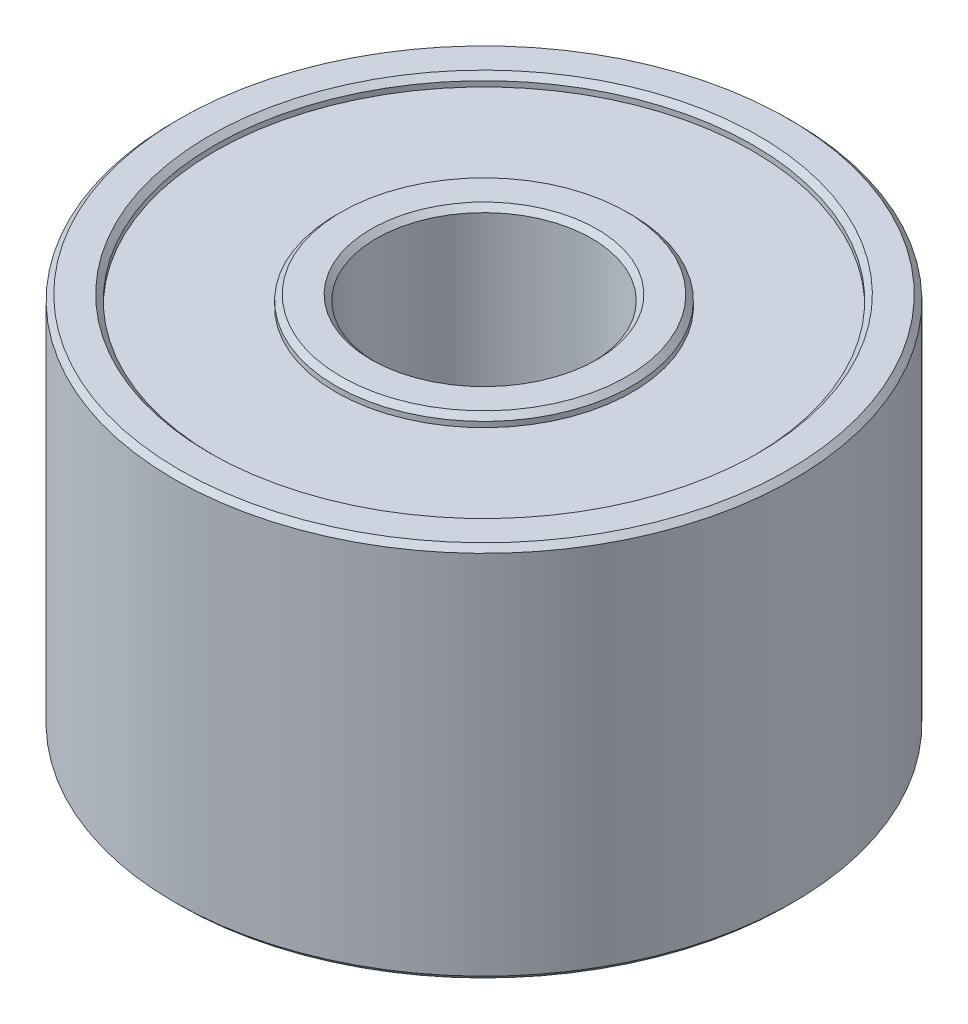
ISO-10303-21;
HEADER;
FILE_DESCRIPTION(('STEP AP214'),'2;1');
FILE_NAME('part.step','',(''),(''),'','','');
FILE_SCHEMA(('AUTOMOTIVE_DESIGN { 1 0 10303 214 1 1 1 1 }'));
ENDSEC;
DATA;
#1=APPLICATION_CONTEXT('core data for automotive mechanical design processes');
#2=APPLICATION_PROTOCOL_DEFINITION('international standard','automotive_design',2000,#1);
#3=PRODUCT_CONTEXT('',#1,'mechanical');
#4=PRODUCT('Part','Part','',(#3));
#5=PRODUCT_RELATED_PRODUCT_CATEGORY('part','',(#4));
#6=PRODUCT_DEFINITION_FORMATION('','',#4);
#7=PRODUCT_DEFINITION_CONTEXT('part definition',#1,'design');
#8=PRODUCT_DEFINITION('design','',#6,#7);
#9=PRODUCT_DEFINITION_SHAPE('','',#8);
#10=(LENGTH_UNIT() NAMED_UNIT(*) SI_UNIT(.MILLI.,.METRE.));
#11=(NAMED_UNIT(*) PLANE_ANGLE_UNIT() SI_UNIT($,.RADIAN.));
#12=(NAMED_UNIT(*) SI_UNIT($,.STERADIAN.) SOLID_ANGLE_UNIT());
#13=UNCERTAINTY_MEASURE_WITH_UNIT(LENGTH_MEASURE(1.E-05),#10,'distance_accuracy_value','');
#14=(GEOMETRIC_REPRESENTATION_CONTEXT(3) GLOBAL_UNCERTAINTY_ASSIGNED_CONTEXT((#13)) GLOBAL_UNIT_ASSIGNED_CONTEXT((#10,
#11,#12)) REPRESENTATION_CONTEXT('',''));
#15=CARTESIAN_POINT('',(0.,0.,0.));
#16=DIRECTION('',(0.,0.,1.));
#17=DIRECTION('',(1.,0.,0.));
#18=AXIS2_PLACEMENT_3D('',#15,#16,#17);
#19=CARTESIAN_POINT('',(0.,0.,0.));
#20=DIRECTION('',(0.,1.,0.));
#21=DIRECTION('',(0.,0.,1.));
#22=AXIS2_PLACEMENT_3D('',#19,#20,#21);
#23=PLANE('',#22);
#24=CARTESIAN_POINT('',(0.,0.,0.));
#25=DIRECTION('',(0.,1.,0.));
#26=DIRECTION('',(0.,0.,1.));
#27=AXIS2_PLACEMENT_3D('',#24,#25,#26);
#28=CIRCLE('',#27,5.3);
#29=CARTESIAN_POINT('',(0.,0.,5.3));
#30=VERTEX_POINT('',#29);
#31=EDGE_CURVE('E38',#30,#30,#28,.F.);
#32=ORIENTED_EDGE('',*,*,#31,.T.);
#33=EDGE_LOOP('',(#32));
#34=FACE_BOUND('',#33,.T.);
#35=CARTESIAN_POINT('',(0.,0.,0.));
#36=DIRECTION('',(0.,1.,0.));
#37=DIRECTION('',(0.,0.,1.));
#38=AXIS2_PLACEMENT_3D('',#35,#36,#37);
#39=CIRCLE('',#38,4.2);
#40=CARTESIAN_POINT('',(0.,0.,4.2));
#41=VERTEX_POINT('',#40);
#42=EDGE_CURVE('E42',#41,#41,#39,.T.);
#43=ORIENTED_EDGE('',*,*,#42,.T.);
#44=EDGE_LOOP('',(#43));
#45=FACE_BOUND('',#44,.T.);
#46=ADVANCED_FACE('F31',(#34,#45),#23,.F.);
#47=CARTESIAN_POINT('',(0.,14.,0.));
#48=DIRECTION('',(0.,1.,0.));
#49=DIRECTION('',(0.,0.,1.));
#50=AXIS2_PLACEMENT_3D('',#47,#48,#49);
#51=PLANE('',#50);
#52=CARTESIAN_POINT('',(0.,14.,0.));
#53=DIRECTION('',(0.,1.,0.));
#54=DIRECTION('',(0.,0.,1.));
#55=AXIS2_PLACEMENT_3D('',#52,#53,#54);
#56=CIRCLE('',#55,5.3);
#57=CARTESIAN_POINT('',(0.,14.,5.3));
#58=VERTEX_POINT('',#57);
#59=EDGE_CURVE('E66',#58,#58,#56,.T.);
#60=ORIENTED_EDGE('',*,*,#59,.T.);
#61=EDGE_LOOP('',(#60));
#62=FACE_BOUND('',#61,.T.);
#63=CARTESIAN_POINT('',(0.,14.,0.));
#64=DIRECTION('',(0.,1.,0.));
#65=DIRECTION('',(0.,0.,1.));
#66=AXIS2_PLACEMENT_3D('',#63,#64,#65);
#67=CIRCLE('',#66,4.2);
#68=CARTESIAN_POINT('',(0.,14.,4.2));
#69=VERTEX_POINT('',#68);
#70=EDGE_CURVE('E69',#69,#69,#67,.F.);
#71=ORIENTED_EDGE('',*,*,#70,.T.);
#72=EDGE_LOOP('',(#71));
#73=FACE_BOUND('',#72,.T.);
#74=ADVANCED_FACE('F120',(#62,#73),#51,.T.);
#75=CARTESIAN_POINT('',(0.,14.,0.));
#76=DIRECTION('',(0.,-1.,0.));
#77=DIRECTION('',(0.,0.,-1.));
#78=AXIS2_PLACEMENT_3D('',#75,#76,#77);
#79=CYLINDRICAL_SURFACE('',#78,11.5);
#80=CARTESIAN_POINT('',(0.,13.8,0.));
#81=DIRECTION('',(0.,1.,0.));
#82=DIRECTION('',(0.,0.,1.));
#83=AXIS2_PLACEMENT_3D('',#80,#81,#82);
#84=CIRCLE('',#83,11.5);
#85=CARTESIAN_POINT('',(0.,13.8,11.5));
#86=VERTEX_POINT('',#85);
#87=EDGE_CURVE('E75',#86,#86,#84,.F.);
#88=ORIENTED_EDGE('',*,*,#87,.T.);
#89=EDGE_LOOP('',(#88));
#90=FACE_BOUND('',#89,.T.);
#91=CARTESIAN_POINT('',(0.,0.200000000000002,0.));
#92=DIRECTION('',(0.,1.,0.));
#93=DIRECTION('',(0.,0.,1.));
#94=AXIS2_PLACEMENT_3D('',#91,#92,#93);
#95=CIRCLE('',#94,11.5);
#96=CARTESIAN_POINT('',(0.,0.200000000000002,11.5));
#97=VERTEX_POINT('',#96);
#98=EDGE_CURVE('E78',#97,#97,#95,.T.);
#99=ORIENTED_EDGE('',*,*,#98,.T.);
#100=EDGE_LOOP('',(#99));
#101=FACE_BOUND('',#100,.T.);
#102=ADVANCED_FACE('F126',(#90,#101),#79,.T.);
#103=CARTESIAN_POINT('',(0.,14.,0.));
#104=DIRECTION('',(0.,1.,0.));
#105=DIRECTION('',(0.,0.,1.));
#106=AXIS2_PLACEMENT_3D('',#103,#104,#105);
#107=CIRCLE('',#106,11.3);
#108=CARTESIAN_POINT('',(0.,14.,11.3));
#109=VERTEX_POINT('',#108);
#110=EDGE_CURVE('E81',#109,#109,#107,.T.);
#111=ORIENTED_EDGE('',*,*,#110,.T.);
#112=EDGE_LOOP('',(#111));
#113=FACE_BOUND('',#112,.T.);
#114=CARTESIAN_POINT('',(0.,14.,0.));
#115=DIRECTION('',(0.,1.,0.));
#116=DIRECTION('',(0.,0.,1.));
#117=AXIS2_PLACEMENT_3D('',#114,#115,#116);
#118=CIRCLE('',#117,10.2);
#119=CARTESIAN_POINT('',(0.,14.,10.2));
#120=VERTEX_POINT('',#119);
#121=EDGE_CURVE('E84',#120,#120,#118,.F.);
#122=ORIENTED_EDGE('',*,*,#121,.T.);
#123=EDGE_LOOP('',(#122));
#124=FACE_BOUND('',#123,.T.);
#125=ADVANCED_FACE('F129',(#113,#124),#51,.T.);
#126=CARTESIAN_POINT('',(0.,0.,0.));
#127=DIRECTION('',(0.,1.,0.));
#128=DIRECTION('',(0.,0.,1.));
#129=AXIS2_PLACEMENT_3D('',#126,#127,#128);
#130=CIRCLE('',#129,11.3);
#131=CARTESIAN_POINT('',(0.,0.,11.3));
#132=VERTEX_POINT('',#131);
#133=EDGE_CURVE('E51',#132,#132,#130,.F.);
#134=ORIENTED_EDGE('',*,*,#133,.T.);
#135=EDGE_LOOP('',(#134));
#136=FACE_BOUND('',#135,.T.);
#137=CARTESIAN_POINT('',(0.,0.,0.));
#138=DIRECTION('',(0.,1.,0.));
#139=DIRECTION('',(0.,0.,1.));
#140=AXIS2_PLACEMENT_3D('',#137,#138,#139);
#141=CIRCLE('',#140,10.2);
#142=CARTESIAN_POINT('',(0.,0.,10.2));
#143=VERTEX_POINT('',#142);
#144=EDGE_CURVE('E54',#143,#143,#141,.T.);
#145=ORIENTED_EDGE('',*,*,#144,.T.);
#146=EDGE_LOOP('',(#145));
#147=FACE_BOUND('',#146,.T.);
#148=ADVANCED_FACE('F122',(#136,#147),#23,.F.);
#149=CARTESIAN_POINT('',(0.,-10.,0.));
#150=DIRECTION('',(0.,1.,0.));
#151=DIRECTION('',(0.,0.,1.));
#152=AXIS2_PLACEMENT_3D('',#149,#150,#151);
#153=CYLINDRICAL_SURFACE('',#152,4.);
#154=CARTESIAN_POINT('',(0.,13.8,0.));
#155=DIRECTION('',(0.,1.,0.));
#156=DIRECTION('',(0.,0.,1.));
#157=AXIS2_PLACEMENT_3D('',#154,#155,#156);
#158=CIRCLE('',#157,4.);
#159=CARTESIAN_POINT('',(0.,13.8,4.));
#160=VERTEX_POINT('',#159);
#161=EDGE_CURVE('E57',#160,#160,#158,.T.);
#162=ORIENTED_EDGE('',*,*,#161,.T.);
#163=EDGE_LOOP('',(#162));
#164=FACE_BOUND('',#163,.T.);
#165=CARTESIAN_POINT('',(0.,0.199999999999992,0.));
#166=DIRECTION('',(0.,1.,0.));
#167=DIRECTION('',(0.,0.,1.));
#168=AXIS2_PLACEMENT_3D('',#165,#166,#167);
#169=CIRCLE('',#168,4.);
#170=CARTESIAN_POINT('',(0.,0.199999999999992,4.));
#171=VERTEX_POINT('',#170);
#172=EDGE_CURVE('E60',#171,#171,#169,.F.);
#173=ORIENTED_EDGE('',*,*,#172,.T.);
#174=EDGE_LOOP('',(#173));
#175=FACE_BOUND('',#174,.T.);
#176=ADVANCED_FACE('F133',(#164,#175),#153,.F.);
#177=CARTESIAN_POINT('',(0.,13.6,0.));
#178=DIRECTION('',(0.,1.,0.));
#179=DIRECTION('',(0.,0.,1.));
#180=AXIS2_PLACEMENT_3D('',#177,#178,#179);
#181=CYLINDRICAL_SURFACE('',#180,10.);
#182=CARTESIAN_POINT('',(0.,13.8,0.));
#183=DIRECTION('',(0.,1.,0.));
#184=DIRECTION('',(0.,0.,1.));
#185=AXIS2_PLACEMENT_3D('',#182,#183,#184);
#186=CIRCLE('',#185,10.);
#187=CARTESIAN_POINT('',(0.,13.8,10.));
#188=VERTEX_POINT('',#187);
#189=EDGE_CURVE('E72',#188,#188,#186,.T.);
#190=ORIENTED_EDGE('',*,*,#189,.T.);
#191=EDGE_LOOP('',(#190));
#192=FACE_BOUND('',#191,.T.);
#193=CARTESIAN_POINT('',(0.,13.6,0.));
#194=DIRECTION('',(0.,1.,0.));
#195=DIRECTION('',(0.,0.,1.));
#196=AXIS2_PLACEMENT_3D('',#193,#194,#195);
#197=CIRCLE('',#196,10.);
#198=CARTESIAN_POINT('',(0.,13.6,10.));
#199=VERTEX_POINT('',#198);
#200=EDGE_CURVE('E87',#199,#199,#197,.T.);
#201=ORIENTED_EDGE('',*,*,#200,.F.);
#202=EDGE_LOOP('',(#201));
#203=FACE_BOUND('',#202,.T.);
#204=ADVANCED_FACE('F139',(#192,#203),#181,.F.);
#205=CARTESIAN_POINT('',(0.,13.6,0.));
#206=DIRECTION('',(0.,1.,0.));
#207=DIRECTION('',(0.,0.,1.));
#208=AXIS2_PLACEMENT_3D('',#205,#206,#207);
#209=PLANE('',#208);
#210=CARTESIAN_POINT('',(0.,13.6,0.));
#211=DIRECTION('',(0.,1.,0.));
#212=DIRECTION('',(0.,0.,1.));
#213=AXIS2_PLACEMENT_3D('',#210,#211,#212);
#214=CIRCLE('',#213,5.5);
#215=CARTESIAN_POINT('',(0.,13.6,5.5));
#216=VERTEX_POINT('',#215);
#217=EDGE_CURVE('E90',#216,#216,#214,.T.);
#218=ORIENTED_EDGE('',*,*,#217,.F.);
#219=EDGE_LOOP('',(#218));
#220=FACE_BOUND('',#219,.T.);
#221=ORIENTED_EDGE('',*,*,#200,.T.);
#222=EDGE_LOOP('',(#221));
#223=FACE_BOUND('',#222,.T.);
#224=ADVANCED_FACE('F116',(#220,#223),#209,.T.);
#225=CARTESIAN_POINT('',(0.,13.6,0.));
#226=DIRECTION('',(0.,1.,0.));
#227=DIRECTION('',(0.,0.,1.));
#228=AXIS2_PLACEMENT_3D('',#225,#226,#227);
#229=CYLINDRICAL_SURFACE('',#228,5.5);
#230=CARTESIAN_POINT('',(0.,13.8,0.));
#231=DIRECTION('',(0.,1.,0.));
#232=DIRECTION('',(0.,0.,1.));
#233=AXIS2_PLACEMENT_3D('',#230,#231,#232);
#234=CIRCLE('',#233,5.5);
#235=CARTESIAN_POINT('',(0.,13.8,5.5));
#236=VERTEX_POINT('',#235);
#237=EDGE_CURVE('E63',#236,#236,#234,.F.);
#238=ORIENTED_EDGE('',*,*,#237,.T.);
#239=EDGE_LOOP('',(#238));
#240=FACE_BOUND('',#239,.T.);
#241=ORIENTED_EDGE('',*,*,#217,.T.);
#242=EDGE_LOOP('',(#241));
#243=FACE_BOUND('',#242,.T.);
#244=ADVANCED_FACE('F110',(#240,#243),#229,.T.);
#245=CARTESIAN_POINT('',(0.,0.4,0.));
#246=DIRECTION('',(0.,-1.,0.));
#247=DIRECTION('',(0.,0.,-1.));
#248=AXIS2_PLACEMENT_3D('',#245,#246,#247);
#249=CYLINDRICAL_SURFACE('',#248,10.);
#250=CARTESIAN_POINT('',(0.,0.199999999999997,0.));
#251=DIRECTION('',(0.,1.,0.));
#252=DIRECTION('',(0.,0.,1.));
#253=AXIS2_PLACEMENT_3D('',#250,#251,#252);
#254=CIRCLE('',#253,10.);
#255=CARTESIAN_POINT('',(0.,0.199999999999997,10.));
#256=VERTEX_POINT('',#255);
#257=EDGE_CURVE('E46',#256,#256,#254,.F.);
#258=ORIENTED_EDGE('',*,*,#257,.T.);
#259=EDGE_LOOP('',(#258));
#260=FACE_BOUND('',#259,.T.);
#261=CARTESIAN_POINT('',(0.,0.4,0.));
#262=DIRECTION('',(0.,-1.,0.));
#263=DIRECTION('',(0.,0.,-1.));
#264=AXIS2_PLACEMENT_3D('',#261,#262,#263);
#265=CIRCLE('',#264,10.);
#266=CARTESIAN_POINT('',(0.,0.4,-10.));
#267=VERTEX_POINT('',#266);
#268=EDGE_CURVE('E93',#267,#267,#265,.T.);
#269=ORIENTED_EDGE('',*,*,#268,.F.);
#270=EDGE_LOOP('',(#269));
#271=FACE_BOUND('',#270,.T.);
#272=ADVANCED_FACE('F105',(#260,#271),#249,.F.);
#273=CARTESIAN_POINT('',(0.,0.4,0.));
#274=DIRECTION('',(0.,-1.,0.));
#275=DIRECTION('',(0.,0.,-1.));
#276=AXIS2_PLACEMENT_3D('',#273,#274,#275);
#277=PLANE('',#276);
#278=CARTESIAN_POINT('',(0.,0.4,0.));
#279=DIRECTION('',(0.,-1.,0.));
#280=DIRECTION('',(0.,0.,-1.));
#281=AXIS2_PLACEMENT_3D('',#278,#279,#280);
#282=CIRCLE('',#281,5.5);
#283=CARTESIAN_POINT('',(0.,0.4,-5.5));
#284=VERTEX_POINT('',#283);
#285=EDGE_CURVE('E96',#284,#284,#282,.T.);
#286=ORIENTED_EDGE('',*,*,#285,.F.);
#287=EDGE_LOOP('',(#286));
#288=FACE_BOUND('',#287,.T.);
#289=ORIENTED_EDGE('',*,*,#268,.T.);
#290=EDGE_LOOP('',(#289));
#291=FACE_BOUND('',#290,.T.);
#292=ADVANCED_FACE('F102',(#288,#291),#277,.T.);
#293=CARTESIAN_POINT('',(0.,0.4,0.));
#294=DIRECTION('',(0.,-1.,0.));
#295=DIRECTION('',(0.,0.,-1.));
#296=AXIS2_PLACEMENT_3D('',#293,#294,#295);
#297=CYLINDRICAL_SURFACE('',#296,5.5);
#298=CARTESIAN_POINT('',(0.,0.199999999999999,0.));
#299=DIRECTION('',(0.,1.,0.));
#300=DIRECTION('',(0.,0.,1.));
#301=AXIS2_PLACEMENT_3D('',#298,#299,#300);
#302=CIRCLE('',#301,5.5);
#303=CARTESIAN_POINT('',(0.,0.199999999999999,5.5));
#304=VERTEX_POINT('',#303);
#305=EDGE_CURVE('E10',#304,#304,#302,.T.);
#306=ORIENTED_EDGE('',*,*,#305,.T.);
#307=EDGE_LOOP('',(#306));
#308=FACE_BOUND('',#307,.T.);
#309=ORIENTED_EDGE('',*,*,#285,.T.);
#310=EDGE_LOOP('',(#309));
#311=FACE_BOUND('',#310,.T.);
#312=ADVANCED_FACE('F100',(#308,#311),#297,.T.);
#313=CARTESIAN_POINT('',(0.,14.,0.));
#314=DIRECTION('',(0.,-1.,0.));
#315=DIRECTION('',(0.,0.,-1.));
#316=AXIS2_PLACEMENT_3D('',#313,#314,#315);
#317=CONICAL_SURFACE('',#316,11.3,0.785398163397435);
#318=ORIENTED_EDGE('',*,*,#87,.F.);
#319=EDGE_LOOP('',(#318));
#320=FACE_BOUND('',#319,.T.);
#321=ORIENTED_EDGE('',*,*,#110,.F.);
#322=EDGE_LOOP('',(#321));
#323=FACE_BOUND('',#322,.T.);
#324=ADVANCED_FACE('F173',(#320,#323),#317,.T.);
#325=CARTESIAN_POINT('',(0.,13.8,0.));
#326=DIRECTION('',(0.,1.,0.));
#327=DIRECTION('',(0.,0.,1.));
#328=AXIS2_PLACEMENT_3D('',#325,#326,#327);
#329=CONICAL_SURFACE('',#328,10.,0.785398163397457);
#330=ORIENTED_EDGE('',*,*,#121,.F.);
#331=EDGE_LOOP('',(#330));
#332=FACE_BOUND('',#331,.T.);
#333=ORIENTED_EDGE('',*,*,#189,.F.);
#334=EDGE_LOOP('',(#333));
#335=FACE_BOUND('',#334,.T.);
#336=ADVANCED_FACE('F169',(#332,#335),#329,.F.);
#337=CARTESIAN_POINT('',(0.,14.,0.));
#338=DIRECTION('',(0.,-1.,0.));
#339=DIRECTION('',(0.,0.,-1.));
#340=AXIS2_PLACEMENT_3D('',#337,#338,#339);
#341=CONICAL_SURFACE('',#340,5.3,0.785398163397444);
#342=ORIENTED_EDGE('',*,*,#237,.F.);
#343=EDGE_LOOP('',(#342));
#344=FACE_BOUND('',#343,.T.);
#345=ORIENTED_EDGE('',*,*,#59,.F.);
#346=EDGE_LOOP('',(#345));
#347=FACE_BOUND('',#346,.T.);
#348=ADVANCED_FACE('F165',(#344,#347),#341,.T.);
#349=CARTESIAN_POINT('',(0.,13.8,0.));
#350=DIRECTION('',(0.,1.,0.));
#351=DIRECTION('',(0.,0.,1.));
#352=AXIS2_PLACEMENT_3D('',#349,#350,#351);
#353=CONICAL_SURFACE('',#352,4.,0.78539816339744);
#354=ORIENTED_EDGE('',*,*,#70,.F.);
#355=EDGE_LOOP('',(#354));
#356=FACE_BOUND('',#355,.T.);
#357=ORIENTED_EDGE('',*,*,#161,.F.);
#358=EDGE_LOOP('',(#357));
#359=FACE_BOUND('',#358,.T.);
#360=ADVANCED_FACE('F159',(#356,#359),#353,.F.);
#361=CARTESIAN_POINT('',(0.,0.200000000000002,0.));
#362=DIRECTION('',(0.,1.,0.));
#363=DIRECTION('',(0.,0.,1.));
#364=AXIS2_PLACEMENT_3D('',#361,#362,#363);
#365=CONICAL_SURFACE('',#364,11.5,0.785398163397448);
#366=ORIENTED_EDGE('',*,*,#133,.F.);
#367=EDGE_LOOP('',(#366));
#368=FACE_BOUND('',#367,.T.);
#369=ORIENTED_EDGE('',*,*,#98,.F.);
#370=EDGE_LOOP('',(#369));
#371=FACE_BOUND('',#370,.T.);
#372=ADVANCED_FACE('F151',(#368,#371),#365,.T.);
#373=CARTESIAN_POINT('',(0.,0.199999999999997,0.));
#374=DIRECTION('',(0.,-1.,0.));
#375=DIRECTION('',(0.,0.,-1.));
#376=AXIS2_PLACEMENT_3D('',#373,#374,#375);
#377=CONICAL_SURFACE('',#376,10.,0.78539816339744);
#378=ORIENTED_EDGE('',*,*,#144,.F.);
#379=EDGE_LOOP('',(#378));
#380=FACE_BOUND('',#379,.T.);
#381=ORIENTED_EDGE('',*,*,#257,.F.);
#382=EDGE_LOOP('',(#381));
#383=FACE_BOUND('',#382,.T.);
#384=ADVANCED_FACE('F147',(#380,#383),#377,.F.);
#385=CARTESIAN_POINT('',(0.,0.,0.));
#386=DIRECTION('',(0.,1.,0.));
#387=DIRECTION('',(0.,0.,1.));
#388=AXIS2_PLACEMENT_3D('',#385,#386,#387);
#389=CONICAL_SURFACE('',#388,5.3,0.785398163397453);
#390=ORIENTED_EDGE('',*,*,#305,.F.);
#391=EDGE_LOOP('',(#390));
#392=FACE_BOUND('',#391,.T.);
#393=ORIENTED_EDGE('',*,*,#31,.F.);
#394=EDGE_LOOP('',(#393));
#395=FACE_BOUND('',#394,.T.);
#396=ADVANCED_FACE('F150',(#392,#395),#389,.T.);
#397=CARTESIAN_POINT('',(0.,0.,0.));
#398=DIRECTION('',(0.,-1.,0.));
#399=DIRECTION('',(0.,0.,-1.));
#400=AXIS2_PLACEMENT_3D('',#397,#398,#399);
#401=CONICAL_SURFACE('',#400,4.2,0.785398163397457);
#402=ORIENTED_EDGE('',*,*,#172,.F.);
#403=EDGE_LOOP('',(#402));
#404=FACE_BOUND('',#403,.T.);
#405=ORIENTED_EDGE('',*,*,#42,.F.);
#406=EDGE_LOOP('',(#405));
#407=FACE_BOUND('',#406,.T.);
#408=ADVANCED_FACE('F33',(#404,#407),#401,.F.);
#409=CLOSED_SHELL('',(#46,#74,#102,#125,#148,#176,#204,#224,#244,#272,#292,#312,#324,#336,#348,
#360,#372,#384,#396,#408));
#410=MANIFOLD_SOLID_BREP('B2',#409);
#411=ADVANCED_BREP_SHAPE_REPRESENTATION('',(#18,#410),#14);
#412=SHAPE_DEFINITION_REPRESENTATION(#9,#411);
ENDSEC;
END-ISO-10303-21;
